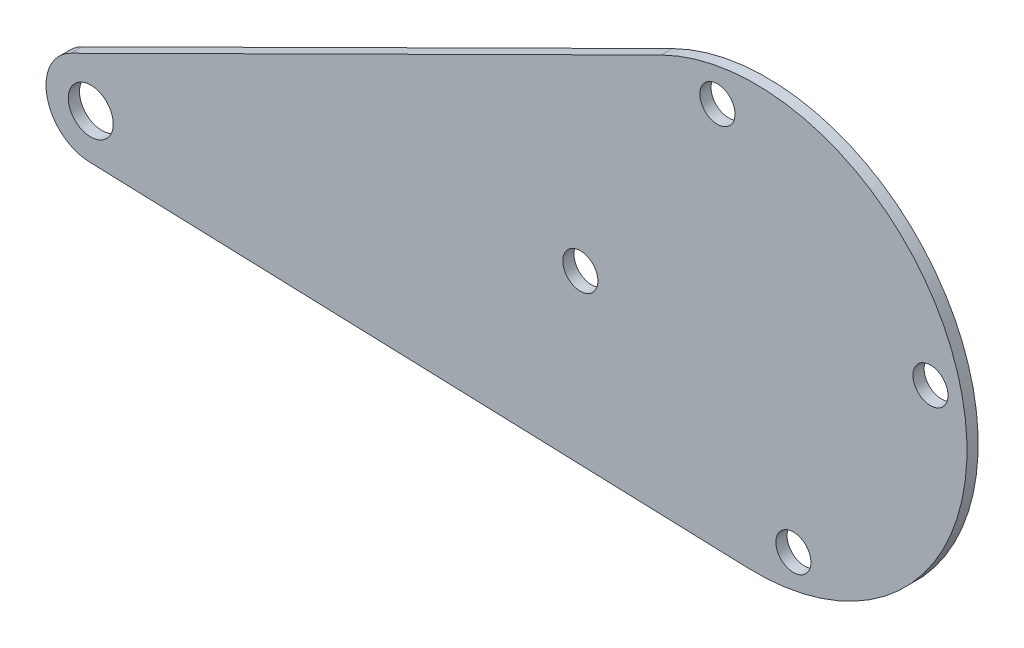
ISO-10303-21;
HEADER;
FILE_DESCRIPTION(('STEP AP214'),'2;1');
FILE_NAME('part.step','',(''),(''),'','','');
FILE_SCHEMA(('AUTOMOTIVE_DESIGN { 1 0 10303 214 1 1 1 1 }'));
ENDSEC;
DATA;
#1=APPLICATION_CONTEXT('core data for automotive mechanical design processes');
#2=APPLICATION_PROTOCOL_DEFINITION('international standard','automotive_design',2000,#1);
#3=PRODUCT_CONTEXT('',#1,'mechanical');
#4=PRODUCT('Part','Part','',(#3));
#5=PRODUCT_RELATED_PRODUCT_CATEGORY('part','',(#4));
#6=PRODUCT_DEFINITION_FORMATION('','',#4);
#7=PRODUCT_DEFINITION_CONTEXT('part definition',#1,'design');
#8=PRODUCT_DEFINITION('design','',#6,#7);
#9=PRODUCT_DEFINITION_SHAPE('','',#8);
#10=(LENGTH_UNIT() NAMED_UNIT(*) SI_UNIT(.MILLI.,.METRE.));
#11=(NAMED_UNIT(*) PLANE_ANGLE_UNIT() SI_UNIT($,.RADIAN.));
#12=(NAMED_UNIT(*) SI_UNIT($,.STERADIAN.) SOLID_ANGLE_UNIT());
#13=UNCERTAINTY_MEASURE_WITH_UNIT(LENGTH_MEASURE(1.E-05),#10,'distance_accuracy_value','');
#14=(GEOMETRIC_REPRESENTATION_CONTEXT(3) GLOBAL_UNCERTAINTY_ASSIGNED_CONTEXT((#13)) GLOBAL_UNIT_ASSIGNED_CONTEXT((#10,
#11,#12)) REPRESENTATION_CONTEXT('',''));
#15=CARTESIAN_POINT('',(0.,0.,0.));
#16=DIRECTION('',(0.,0.,1.));
#17=DIRECTION('',(1.,0.,0.));
#18=AXIS2_PLACEMENT_3D('',#15,#16,#17);
#19=CARTESIAN_POINT('',(-365.944406352248,81.1413678208047,324.64375));
#20=DIRECTION('',(0.,0.,1.));
#21=DIRECTION('',(1.,0.,0.));
#22=AXIS2_PLACEMENT_3D('',#19,#20,#21);
#23=PLANE('',#22);
#24=CARTESIAN_POINT('',(-246.881486180575,106.988530086442,324.64375));
#25=DIRECTION('',(0.,0.,1.));
#26=DIRECTION('',(1.,0.,0.));
#27=AXIS2_PLACEMENT_3D('',#24,#25,#26);
#28=CIRCLE('',#27,2.4892);
#29=CARTESIAN_POINT('',(-244.392286180575,106.988530086442,324.64375));
#30=VERTEX_POINT('',#29);
#31=EDGE_CURVE('E130',#30,#30,#28,.T.);
#32=ORIENTED_EDGE('',*,*,#31,.F.);
#33=EDGE_LOOP('',(#32));
#34=FACE_BOUND('',#33,.T.);
#35=CARTESIAN_POINT('',(-296.525166282176,96.2114699135577,324.64375));
#36=DIRECTION('',(0.,0.,1.));
#37=DIRECTION('',(1.,0.,0.));
#38=AXIS2_PLACEMENT_3D('',#35,#36,#37);
#39=CIRCLE('',#38,2.48919999999983);
#40=CARTESIAN_POINT('',(-294.035966282176,96.2114699135577,324.64375));
#41=VERTEX_POINT('',#40);
#42=EDGE_CURVE('E118',#41,#41,#39,.T.);
#43=ORIENTED_EDGE('',*,*,#42,.F.);
#44=EDGE_LOOP('',(#43));
#45=FACE_BOUND('',#44,.T.);
#46=CARTESIAN_POINT('',(-365.944406352248,81.1413678208047,324.64375));
#47=DIRECTION('',(0.,0.,1.));
#48=DIRECTION('',(1.,0.,0.));
#49=AXIS2_PLACEMENT_3D('',#46,#47,#48);
#50=CIRCLE('',#49,6.35);
#51=CARTESIAN_POINT('',(-368.772227153917,86.8269574572143,324.64375));
#52=VERTEX_POINT('',#51);
#53=CARTESIAN_POINT('',(-366.160238440042,74.7950368721479,324.64375));
#54=VERTEX_POINT('',#53);
#55=EDGE_CURVE('E88',#52,#54,#50,.T.);
#56=ORIENTED_EDGE('',*,*,#55,.T.);
#57=DIRECTION('',(0.999422196638862,-0.0339893051643038,0.));
#58=VECTOR('',#57,1.);
#59=CARTESIAN_POINT('',(-272.723005384401,71.617334156802,324.64375));
#60=LINE('',#59,#58);
#61=CARTESIAN_POINT('',(-272.723005384401,71.617334156802,324.64375));
#62=VERTEX_POINT('',#61);
#63=EDGE_CURVE('E83',#54,#62,#60,.T.);
#64=ORIENTED_EDGE('',*,*,#63,.T.);
#65=CARTESIAN_POINT('',(-271.703326231376,101.6,324.64375));
#66=DIRECTION('',(0.,0.,1.));
#67=DIRECTION('',(1.,0.,0.));
#68=AXIS2_PLACEMENT_3D('',#65,#66,#67);
#69=CIRCLE('',#68,29.9999999439998);
#70=CARTESIAN_POINT('',(-285.063109521408,128.46105335022,324.64375));
#71=VERTEX_POINT('',#70);
#72=EDGE_CURVE('E86',#62,#71,#69,.T.);
#73=ORIENTED_EDGE('',*,*,#72,.T.);
#74=DIRECTION('',(-0.895368446678685,-0.445326110499036,0.));
#75=VECTOR('',#74,1.);
#76=CARTESIAN_POINT('',(-368.772227153917,86.8269574572143,324.64375));
#77=LINE('',#76,#75);
#78=EDGE_CURVE('E53',#71,#52,#77,.T.);
#79=ORIENTED_EDGE('',*,*,#78,.T.);
#80=EDGE_LOOP('',(#56,#64,#73,#79));
#81=FACE_BOUND('',#80,.T.);
#82=CARTESIAN_POINT('',(-365.944406352248,81.1413678208047,324.64375));
#83=DIRECTION('',(0.,0.,1.));
#84=DIRECTION('',(1.,0.,0.));
#85=AXIS2_PLACEMENT_3D('',#82,#83,#84);
#86=CIRCLE('',#85,3.1877);
#87=CARTESIAN_POINT('',(-362.756706352248,81.1413678208047,324.64375));
#88=VERTEX_POINT('',#87);
#89=EDGE_CURVE('E103',#88,#88,#86,.T.);
#90=ORIENTED_EDGE('',*,*,#89,.F.);
#91=EDGE_LOOP('',(#90));
#92=FACE_BOUND('',#91,.T.);
#93=CARTESIAN_POINT('',(-266.314796144933,76.7781599491998,324.64375));
#94=DIRECTION('',(0.,0.,1.));
#95=DIRECTION('',(1.,0.,0.));
#96=AXIS2_PLACEMENT_3D('',#93,#94,#95);
#97=CIRCLE('',#96,2.48920000000024);
#98=CARTESIAN_POINT('',(-263.825596144933,76.7781599491998,324.64375));
#99=VERTEX_POINT('',#98);
#100=EDGE_CURVE('E124',#99,#99,#97,.T.);
#101=ORIENTED_EDGE('',*,*,#100,.F.);
#102=EDGE_LOOP('',(#101));
#103=FACE_BOUND('',#102,.T.);
#104=CARTESIAN_POINT('',(-277.091856317818,126.4218400508,324.64375));
#105=DIRECTION('',(0.,0.,1.));
#106=DIRECTION('',(1.,0.,0.));
#107=AXIS2_PLACEMENT_3D('',#104,#105,#106);
#108=CIRCLE('',#107,2.48919999999995);
#109=CARTESIAN_POINT('',(-274.602656317818,126.4218400508,324.64375));
#110=VERTEX_POINT('',#109);
#111=EDGE_CURVE('E136',#110,#110,#108,.T.);
#112=ORIENTED_EDGE('',*,*,#111,.F.);
#113=EDGE_LOOP('',(#112));
#114=FACE_BOUND('',#113,.T.);
#115=ADVANCED_FACE('F36',(#34,#45,#81,#92,#103,#114),#23,.T.);
#116=CARTESIAN_POINT('',(-365.944406352248,81.1413678208047,323.05625));
#117=DIRECTION('',(0.,0.,1.));
#118=DIRECTION('',(1.,0.,0.));
#119=AXIS2_PLACEMENT_3D('',#116,#117,#118);
#120=PLANE('',#119);
#121=CARTESIAN_POINT('',(-365.944406352248,81.1413678208047,323.05625));
#122=DIRECTION('',(0.,0.,1.));
#123=DIRECTION('',(1.,0.,0.));
#124=AXIS2_PLACEMENT_3D('',#121,#122,#123);
#125=CIRCLE('',#124,6.35);
#126=CARTESIAN_POINT('',(-368.772227153917,86.8269574572143,323.05625));
#127=VERTEX_POINT('',#126);
#128=CARTESIAN_POINT('',(-366.160238440042,74.7950368721479,323.05625));
#129=VERTEX_POINT('',#128);
#130=EDGE_CURVE('E100',#127,#129,#125,.T.);
#131=ORIENTED_EDGE('',*,*,#130,.F.);
#132=DIRECTION('',(-0.895368446678685,-0.445326110499036,0.));
#133=VECTOR('',#132,1.);
#134=CARTESIAN_POINT('',(-368.772227153917,86.8269574572143,323.05625));
#135=LINE('',#134,#133);
#136=CARTESIAN_POINT('',(-285.063109521408,128.46105335022,323.05625));
#137=VERTEX_POINT('',#136);
#138=EDGE_CURVE('E76',#137,#127,#135,.T.);
#139=ORIENTED_EDGE('',*,*,#138,.F.);
#140=CARTESIAN_POINT('',(-271.703326231376,101.6,323.05625));
#141=DIRECTION('',(0.,0.,1.));
#142=DIRECTION('',(1.,0.,0.));
#143=AXIS2_PLACEMENT_3D('',#140,#141,#142);
#144=CIRCLE('',#143,29.9999999439998);
#145=CARTESIAN_POINT('',(-272.723005384401,71.617334156802,323.05625));
#146=VERTEX_POINT('',#145);
#147=EDGE_CURVE('E70',#146,#137,#144,.T.);
#148=ORIENTED_EDGE('',*,*,#147,.F.);
#149=DIRECTION('',(0.999422196638862,-0.0339893051643038,0.));
#150=VECTOR('',#149,1.);
#151=CARTESIAN_POINT('',(-272.723005384401,71.617334156802,323.05625));
#152=LINE('',#151,#150);
#153=EDGE_CURVE('E92',#129,#146,#152,.T.);
#154=ORIENTED_EDGE('',*,*,#153,.F.);
#155=EDGE_LOOP('',(#131,#139,#148,#154));
#156=FACE_BOUND('',#155,.T.);
#157=CARTESIAN_POINT('',(-365.944406352248,81.1413678208047,323.05625));
#158=DIRECTION('',(0.,0.,1.));
#159=DIRECTION('',(1.,0.,0.));
#160=AXIS2_PLACEMENT_3D('',#157,#158,#159);
#161=CIRCLE('',#160,3.1877);
#162=CARTESIAN_POINT('',(-362.756706352248,81.1413678208047,323.05625));
#163=VERTEX_POINT('',#162);
#164=EDGE_CURVE('E115',#163,#163,#161,.T.);
#165=ORIENTED_EDGE('',*,*,#164,.T.);
#166=EDGE_LOOP('',(#165));
#167=FACE_BOUND('',#166,.T.);
#168=CARTESIAN_POINT('',(-296.525166282176,96.2114699135577,323.05625));
#169=DIRECTION('',(0.,0.,1.));
#170=DIRECTION('',(1.,0.,0.));
#171=AXIS2_PLACEMENT_3D('',#168,#169,#170);
#172=CIRCLE('',#171,2.48919999999983);
#173=CARTESIAN_POINT('',(-294.035966282176,96.2114699135577,323.05625));
#174=VERTEX_POINT('',#173);
#175=EDGE_CURVE('E121',#174,#174,#172,.T.);
#176=ORIENTED_EDGE('',*,*,#175,.T.);
#177=EDGE_LOOP('',(#176));
#178=FACE_BOUND('',#177,.T.);
#179=CARTESIAN_POINT('',(-266.314796144933,76.7781599491998,323.05625));
#180=DIRECTION('',(0.,0.,1.));
#181=DIRECTION('',(1.,0.,0.));
#182=AXIS2_PLACEMENT_3D('',#179,#180,#181);
#183=CIRCLE('',#182,2.48920000000024);
#184=CARTESIAN_POINT('',(-263.825596144933,76.7781599491998,323.05625));
#185=VERTEX_POINT('',#184);
#186=EDGE_CURVE('E127',#185,#185,#183,.T.);
#187=ORIENTED_EDGE('',*,*,#186,.T.);
#188=EDGE_LOOP('',(#187));
#189=FACE_BOUND('',#188,.T.);
#190=CARTESIAN_POINT('',(-246.881486180575,106.988530086442,323.05625));
#191=DIRECTION('',(0.,0.,1.));
#192=DIRECTION('',(1.,0.,0.));
#193=AXIS2_PLACEMENT_3D('',#190,#191,#192);
#194=CIRCLE('',#193,2.4892);
#195=CARTESIAN_POINT('',(-244.392286180575,106.988530086442,323.05625));
#196=VERTEX_POINT('',#195);
#197=EDGE_CURVE('E133',#196,#196,#194,.T.);
#198=ORIENTED_EDGE('',*,*,#197,.T.);
#199=EDGE_LOOP('',(#198));
#200=FACE_BOUND('',#199,.T.);
#201=CARTESIAN_POINT('',(-277.091856317818,126.4218400508,323.05625));
#202=DIRECTION('',(0.,0.,1.));
#203=DIRECTION('',(1.,0.,0.));
#204=AXIS2_PLACEMENT_3D('',#201,#202,#203);
#205=CIRCLE('',#204,2.48919999999995);
#206=CARTESIAN_POINT('',(-274.602656317818,126.4218400508,323.05625));
#207=VERTEX_POINT('',#206);
#208=EDGE_CURVE('E139',#207,#207,#205,.T.);
#209=ORIENTED_EDGE('',*,*,#208,.T.);
#210=EDGE_LOOP('',(#209));
#211=FACE_BOUND('',#210,.T.);
#212=ADVANCED_FACE('F111',(#156,#167,#178,#189,#200,#211),#120,.F.);
#213=CARTESIAN_POINT('',(-365.944406352248,81.1413678208047,324.64375));
#214=DIRECTION('',(0.,0.,-1.));
#215=DIRECTION('',(-1.,0.,0.));
#216=AXIS2_PLACEMENT_3D('',#213,#214,#215);
#217=CYLINDRICAL_SURFACE('',#216,6.35);
#218=ORIENTED_EDGE('',*,*,#130,.T.);
#219=DIRECTION('',(0.,0.,-1.));
#220=VECTOR('',#219,1.);
#221=CARTESIAN_POINT('',(-366.160238440042,74.7950368721479,324.64375));
#222=LINE('',#221,#220);
#223=EDGE_CURVE('E11',#54,#129,#222,.T.);
#224=ORIENTED_EDGE('',*,*,#223,.F.);
#225=ORIENTED_EDGE('',*,*,#55,.F.);
#226=DIRECTION('',(0.,0.,-1.));
#227=VECTOR('',#226,1.);
#228=CARTESIAN_POINT('',(-368.772227153917,86.8269574572143,324.64375));
#229=LINE('',#228,#227);
#230=EDGE_CURVE('E96',#52,#127,#229,.T.);
#231=ORIENTED_EDGE('',*,*,#230,.T.);
#232=EDGE_LOOP('',(#218,#224,#225,#231));
#233=FACE_BOUND('',#232,.T.);
#234=ADVANCED_FACE('F38',(#233),#217,.T.);
#235=CARTESIAN_POINT('',(-272.723005384401,71.617334156802,324.64375));
#236=DIRECTION('',(0.0339893051643038,0.999422196638862,0.));
#237=DIRECTION('',(-0.999422196638862,0.0339893051643038,0.));
#238=AXIS2_PLACEMENT_3D('',#235,#236,#237);
#239=PLANE('',#238);
#240=ORIENTED_EDGE('',*,*,#153,.T.);
#241=DIRECTION('',(0.,0.,-1.));
#242=VECTOR('',#241,1.);
#243=CARTESIAN_POINT('',(-272.723005384401,71.617334156802,324.64375));
#244=LINE('',#243,#242);
#245=EDGE_CURVE('E45',#62,#146,#244,.T.);
#246=ORIENTED_EDGE('',*,*,#245,.F.);
#247=ORIENTED_EDGE('',*,*,#63,.F.);
#248=ORIENTED_EDGE('',*,*,#223,.T.);
#249=EDGE_LOOP('',(#240,#246,#247,#248));
#250=FACE_BOUND('',#249,.T.);
#251=ADVANCED_FACE('F91',(#250),#239,.F.);
#252=CARTESIAN_POINT('',(-271.703326231376,101.6,324.64375));
#253=DIRECTION('',(0.,0.,-1.));
#254=DIRECTION('',(-1.,0.,0.));
#255=AXIS2_PLACEMENT_3D('',#252,#253,#254);
#256=CYLINDRICAL_SURFACE('',#255,29.9999999439998);
#257=ORIENTED_EDGE('',*,*,#147,.T.);
#258=DIRECTION('',(0.,0.,-1.));
#259=VECTOR('',#258,1.);
#260=CARTESIAN_POINT('',(-285.063109521408,128.46105335022,324.64375));
#261=LINE('',#260,#259);
#262=EDGE_CURVE('E93',#71,#137,#261,.T.);
#263=ORIENTED_EDGE('',*,*,#262,.F.);
#264=ORIENTED_EDGE('',*,*,#72,.F.);
#265=ORIENTED_EDGE('',*,*,#245,.T.);
#266=EDGE_LOOP('',(#257,#263,#264,#265));
#267=FACE_BOUND('',#266,.T.);
#268=ADVANCED_FACE('F94',(#267),#256,.T.);
#269=CARTESIAN_POINT('',(-368.772227153917,86.8269574572143,324.64375));
#270=DIRECTION('',(0.445326110499036,-0.895368446678684,0.));
#271=DIRECTION('',(0.895368446678684,0.445326110499036,0.));
#272=AXIS2_PLACEMENT_3D('',#269,#270,#271);
#273=PLANE('',#272);
#274=ORIENTED_EDGE('',*,*,#138,.T.);
#275=ORIENTED_EDGE('',*,*,#230,.F.);
#276=ORIENTED_EDGE('',*,*,#78,.F.);
#277=ORIENTED_EDGE('',*,*,#262,.T.);
#278=EDGE_LOOP('',(#274,#275,#276,#277));
#279=FACE_BOUND('',#278,.T.);
#280=ADVANCED_FACE('F108',(#279),#273,.F.);
#281=CARTESIAN_POINT('',(-365.944406352248,81.1413678208047,324.64375));
#282=DIRECTION('',(0.,0.,-1.));
#283=DIRECTION('',(-1.,0.,0.));
#284=AXIS2_PLACEMENT_3D('',#281,#282,#283);
#285=CYLINDRICAL_SURFACE('',#284,3.1877);
#286=ORIENTED_EDGE('',*,*,#89,.T.);
#287=EDGE_LOOP('',(#286));
#288=FACE_BOUND('',#287,.T.);
#289=ORIENTED_EDGE('',*,*,#164,.F.);
#290=EDGE_LOOP('',(#289));
#291=FACE_BOUND('',#290,.T.);
#292=ADVANCED_FACE('F158',(#288,#291),#285,.F.);
#293=CARTESIAN_POINT('',(-296.525166282176,96.2114699135577,324.64375));
#294=DIRECTION('',(0.,0.,-1.));
#295=DIRECTION('',(-1.,0.,0.));
#296=AXIS2_PLACEMENT_3D('',#293,#294,#295);
#297=CYLINDRICAL_SURFACE('',#296,2.48919999999983);
#298=ORIENTED_EDGE('',*,*,#42,.T.);
#299=EDGE_LOOP('',(#298));
#300=FACE_BOUND('',#299,.T.);
#301=ORIENTED_EDGE('',*,*,#175,.F.);
#302=EDGE_LOOP('',(#301));
#303=FACE_BOUND('',#302,.T.);
#304=ADVANCED_FACE('F203',(#300,#303),#297,.F.);
#305=CARTESIAN_POINT('',(-266.314796144933,76.7781599491998,324.64375));
#306=DIRECTION('',(0.,0.,-1.));
#307=DIRECTION('',(-1.,0.,0.));
#308=AXIS2_PLACEMENT_3D('',#305,#306,#307);
#309=CYLINDRICAL_SURFACE('',#308,2.48920000000024);
#310=ORIENTED_EDGE('',*,*,#100,.T.);
#311=EDGE_LOOP('',(#310));
#312=FACE_BOUND('',#311,.T.);
#313=ORIENTED_EDGE('',*,*,#186,.F.);
#314=EDGE_LOOP('',(#313));
#315=FACE_BOUND('',#314,.T.);
#316=ADVANCED_FACE('F211',(#312,#315),#309,.F.);
#317=CARTESIAN_POINT('',(-246.881486180575,106.988530086442,324.64375));
#318=DIRECTION('',(0.,0.,-1.));
#319=DIRECTION('',(-1.,0.,0.));
#320=AXIS2_PLACEMENT_3D('',#317,#318,#319);
#321=CYLINDRICAL_SURFACE('',#320,2.4892);
#322=ORIENTED_EDGE('',*,*,#31,.T.);
#323=EDGE_LOOP('',(#322));
#324=FACE_BOUND('',#323,.T.);
#325=ORIENTED_EDGE('',*,*,#197,.F.);
#326=EDGE_LOOP('',(#325));
#327=FACE_BOUND('',#326,.T.);
#328=ADVANCED_FACE('F219',(#324,#327),#321,.F.);
#329=CARTESIAN_POINT('',(-277.091856317818,126.4218400508,324.64375));
#330=DIRECTION('',(0.,0.,-1.));
#331=DIRECTION('',(-1.,0.,0.));
#332=AXIS2_PLACEMENT_3D('',#329,#330,#331);
#333=CYLINDRICAL_SURFACE('',#332,2.48919999999995);
#334=ORIENTED_EDGE('',*,*,#111,.T.);
#335=EDGE_LOOP('',(#334));
#336=FACE_BOUND('',#335,.T.);
#337=ORIENTED_EDGE('',*,*,#208,.F.);
#338=EDGE_LOOP('',(#337));
#339=FACE_BOUND('',#338,.T.);
#340=ADVANCED_FACE('F145',(#336,#339),#333,.F.);
#341=CLOSED_SHELL('',(#115,#212,#234,#251,#268,#280,#292,#304,#316,#328,#340));
#342=MANIFOLD_SOLID_BREP('B2',#341);
#343=ADVANCED_BREP_SHAPE_REPRESENTATION('',(#18,#342),#14);
#344=SHAPE_DEFINITION_REPRESENTATION(#9,#343);
ENDSEC;
END-ISO-10303-21;
